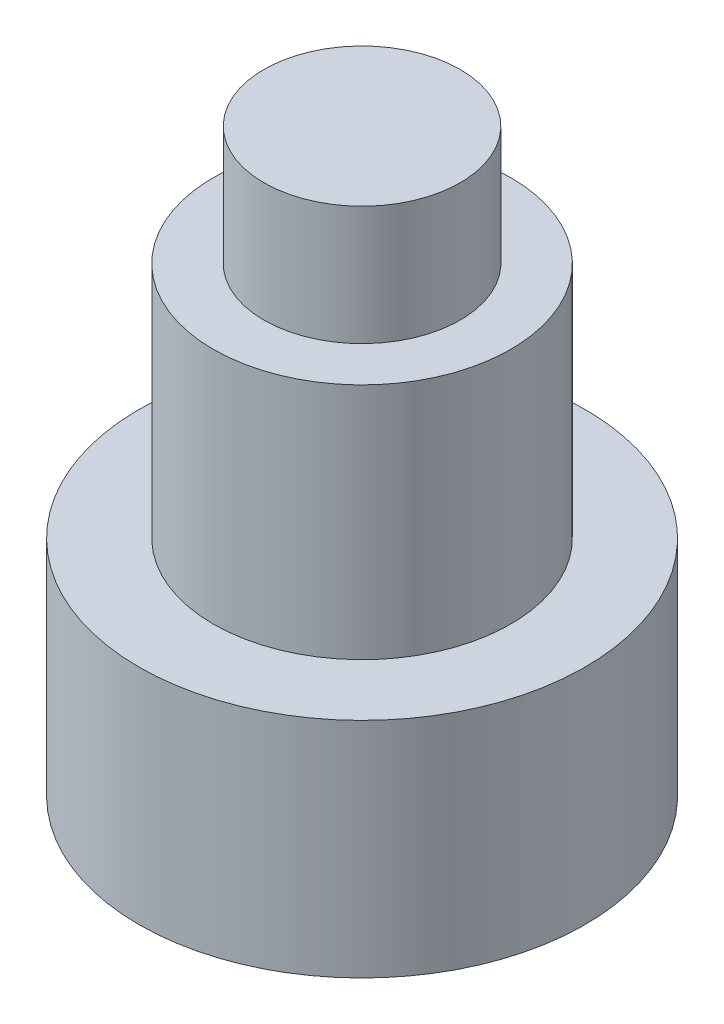
ISO-10303-21;
HEADER;
FILE_DESCRIPTION(('STEP AP214'),'2;1');
FILE_NAME('part.step','',(''),(''),'','','');
FILE_SCHEMA(('AUTOMOTIVE_DESIGN { 1 0 10303 214 1 1 1 1 }'));
ENDSEC;
DATA;
#1=APPLICATION_CONTEXT('core data for automotive mechanical design processes');
#2=APPLICATION_PROTOCOL_DEFINITION('international standard','automotive_design',2000,#1);
#3=PRODUCT_CONTEXT('',#1,'mechanical');
#4=PRODUCT('Part','Part','',(#3));
#5=PRODUCT_RELATED_PRODUCT_CATEGORY('part','',(#4));
#6=PRODUCT_DEFINITION_FORMATION('','',#4);
#7=PRODUCT_DEFINITION_CONTEXT('part definition',#1,'design');
#8=PRODUCT_DEFINITION('design','',#6,#7);
#9=PRODUCT_DEFINITION_SHAPE('','',#8);
#10=(LENGTH_UNIT() NAMED_UNIT(*) SI_UNIT(.MILLI.,.METRE.));
#11=(NAMED_UNIT(*) PLANE_ANGLE_UNIT() SI_UNIT($,.RADIAN.));
#12=(NAMED_UNIT(*) SI_UNIT($,.STERADIAN.) SOLID_ANGLE_UNIT());
#13=UNCERTAINTY_MEASURE_WITH_UNIT(LENGTH_MEASURE(1.E-05),#10,'distance_accuracy_value','');
#14=(GEOMETRIC_REPRESENTATION_CONTEXT(3) GLOBAL_UNCERTAINTY_ASSIGNED_CONTEXT((#13)) GLOBAL_UNIT_ASSIGNED_CONTEXT((#10,
#11,#12)) REPRESENTATION_CONTEXT('',''));
#15=CARTESIAN_POINT('',(0.,0.,0.));
#16=DIRECTION('',(0.,0.,1.));
#17=DIRECTION('',(1.,0.,0.));
#18=AXIS2_PLACEMENT_3D('',#15,#16,#17);
#19=CARTESIAN_POINT('',(0.,7.75,0.));
#20=DIRECTION('',(0.,-1.,0.));
#21=DIRECTION('',(0.,0.,-1.));
#22=AXIS2_PLACEMENT_3D('',#19,#20,#21);
#23=CYLINDRICAL_SURFACE('',#22,3.75);
#24=CARTESIAN_POINT('',(0.,0.,0.));
#25=DIRECTION('',(0.,1.,0.));
#26=DIRECTION('',(0.,0.,1.));
#27=AXIS2_PLACEMENT_3D('',#24,#25,#26);
#28=CIRCLE('',#27,3.75);
#29=CARTESIAN_POINT('',(0.,0.,3.75));
#30=VERTEX_POINT('',#29);
#31=EDGE_CURVE('E40',#30,#30,#28,.T.);
#32=ORIENTED_EDGE('',*,*,#31,.T.);
#33=EDGE_LOOP('',(#32));
#34=FACE_BOUND('',#33,.T.);
#35=CARTESIAN_POINT('',(0.,3.75,0.));
#36=DIRECTION('',(0.,1.,0.));
#37=DIRECTION('',(0.,0.,1.));
#38=AXIS2_PLACEMENT_3D('',#35,#36,#37);
#39=CIRCLE('',#38,3.75);
#40=CARTESIAN_POINT('',(0.,3.75,3.75));
#41=VERTEX_POINT('',#40);
#42=EDGE_CURVE('E50',#41,#41,#39,.T.);
#43=ORIENTED_EDGE('',*,*,#42,.F.);
#44=EDGE_LOOP('',(#43));
#45=FACE_BOUND('',#44,.T.);
#46=ADVANCED_FACE('F37',(#34,#45),#23,.T.);
#47=CARTESIAN_POINT('',(0.,0.,0.));
#48=DIRECTION('',(0.,1.,0.));
#49=DIRECTION('',(0.,0.,1.));
#50=AXIS2_PLACEMENT_3D('',#47,#48,#49);
#51=PLANE('',#50);
#52=ORIENTED_EDGE('',*,*,#31,.F.);
#53=EDGE_LOOP('',(#52));
#54=FACE_BOUND('',#53,.T.);
#55=ADVANCED_FACE('F68',(#54),#51,.F.);
#56=CARTESIAN_POINT('',(0.,3.75,0.));
#57=DIRECTION('',(0.,1.,0.));
#58=DIRECTION('',(0.,0.,1.));
#59=AXIS2_PLACEMENT_3D('',#56,#57,#58);
#60=PLANE('',#59);
#61=CARTESIAN_POINT('',(0.,3.75,0.));
#62=DIRECTION('',(0.,1.,0.));
#63=DIRECTION('',(0.,0.,1.));
#64=AXIS2_PLACEMENT_3D('',#61,#62,#63);
#65=CIRCLE('',#64,2.5);
#66=CARTESIAN_POINT('',(0.,3.75,2.5));
#67=VERTEX_POINT('',#66);
#68=EDGE_CURVE('E54',#67,#67,#65,.T.);
#69=ORIENTED_EDGE('',*,*,#68,.F.);
#70=EDGE_LOOP('',(#69));
#71=FACE_BOUND('',#70,.T.);
#72=ORIENTED_EDGE('',*,*,#42,.T.);
#73=EDGE_LOOP('',(#72));
#74=FACE_BOUND('',#73,.T.);
#75=ADVANCED_FACE('F65',(#71,#74),#60,.T.);
#76=CARTESIAN_POINT('',(0.,3.75,0.));
#77=DIRECTION('',(0.,1.,0.));
#78=DIRECTION('',(0.,0.,1.));
#79=AXIS2_PLACEMENT_3D('',#76,#77,#78);
#80=CYLINDRICAL_SURFACE('',#79,2.5);
#81=ORIENTED_EDGE('',*,*,#68,.T.);
#82=EDGE_LOOP('',(#81));
#83=FACE_BOUND('',#82,.T.);
#84=CARTESIAN_POINT('',(0.,7.75,0.));
#85=DIRECTION('',(0.,1.,0.));
#86=DIRECTION('',(0.,0.,1.));
#87=AXIS2_PLACEMENT_3D('',#84,#85,#86);
#88=CIRCLE('',#87,2.5);
#89=CARTESIAN_POINT('',(0.,7.75,2.5));
#90=VERTEX_POINT('',#89);
#91=EDGE_CURVE('E58',#90,#90,#88,.T.);
#92=ORIENTED_EDGE('',*,*,#91,.F.);
#93=EDGE_LOOP('',(#92));
#94=FACE_BOUND('',#93,.T.);
#95=ADVANCED_FACE('F80',(#83,#94),#80,.T.);
#96=CARTESIAN_POINT('',(0.,7.75,0.));
#97=DIRECTION('',(0.,1.,0.));
#98=DIRECTION('',(0.,0.,1.));
#99=AXIS2_PLACEMENT_3D('',#96,#97,#98);
#100=PLANE('',#99);
#101=CARTESIAN_POINT('',(0.,7.75,0.));
#102=DIRECTION('',(0.,1.,0.));
#103=DIRECTION('',(0.,0.,1.));
#104=AXIS2_PLACEMENT_3D('',#101,#102,#103);
#105=CIRCLE('',#104,1.65);
#106=CARTESIAN_POINT('',(0.,7.75,1.65));
#107=VERTEX_POINT('',#106);
#108=EDGE_CURVE('E10',#107,#107,#105,.T.);
#109=ORIENTED_EDGE('',*,*,#108,.F.);
#110=EDGE_LOOP('',(#109));
#111=FACE_BOUND('',#110,.T.);
#112=ORIENTED_EDGE('',*,*,#91,.T.);
#113=EDGE_LOOP('',(#112));
#114=FACE_BOUND('',#113,.T.);
#115=ADVANCED_FACE('F84',(#111,#114),#100,.T.);
#116=CARTESIAN_POINT('',(0.,9.75,0.));
#117=DIRECTION('',(0.,-1.,0.));
#118=DIRECTION('',(0.,0.,-1.));
#119=AXIS2_PLACEMENT_3D('',#116,#117,#118);
#120=CYLINDRICAL_SURFACE('',#119,1.65);
#121=CARTESIAN_POINT('',(0.,9.75,0.));
#122=DIRECTION('',(0.,1.,0.));
#123=DIRECTION('',(0.,0.,1.));
#124=AXIS2_PLACEMENT_3D('',#121,#122,#123);
#125=CIRCLE('',#124,1.65);
#126=CARTESIAN_POINT('',(0.,9.75,1.65));
#127=VERTEX_POINT('',#126);
#128=EDGE_CURVE('E53',#127,#127,#125,.T.);
#129=ORIENTED_EDGE('',*,*,#128,.F.);
#130=EDGE_LOOP('',(#129));
#131=FACE_BOUND('',#130,.T.);
#132=ORIENTED_EDGE('',*,*,#108,.T.);
#133=EDGE_LOOP('',(#132));
#134=FACE_BOUND('',#133,.T.);
#135=ADVANCED_FACE('F86',(#131,#134),#120,.T.);
#136=CARTESIAN_POINT('',(0.,9.75,0.));
#137=DIRECTION('',(0.,1.,0.));
#138=DIRECTION('',(0.,0.,1.));
#139=AXIS2_PLACEMENT_3D('',#136,#137,#138);
#140=PLANE('',#139);
#141=ORIENTED_EDGE('',*,*,#128,.T.);
#142=EDGE_LOOP('',(#141));
#143=FACE_BOUND('',#142,.T.);
#144=ADVANCED_FACE('F94',(#143),#140,.T.);
#145=CLOSED_SHELL('',(#46,#55,#75,#95,#115,#135,#144));
#146=MANIFOLD_SOLID_BREP('B2',#145);
#147=ADVANCED_BREP_SHAPE_REPRESENTATION('',(#18,#146),#14);
#148=SHAPE_DEFINITION_REPRESENTATION(#9,#147);
ENDSEC;
END-ISO-10303-21;
